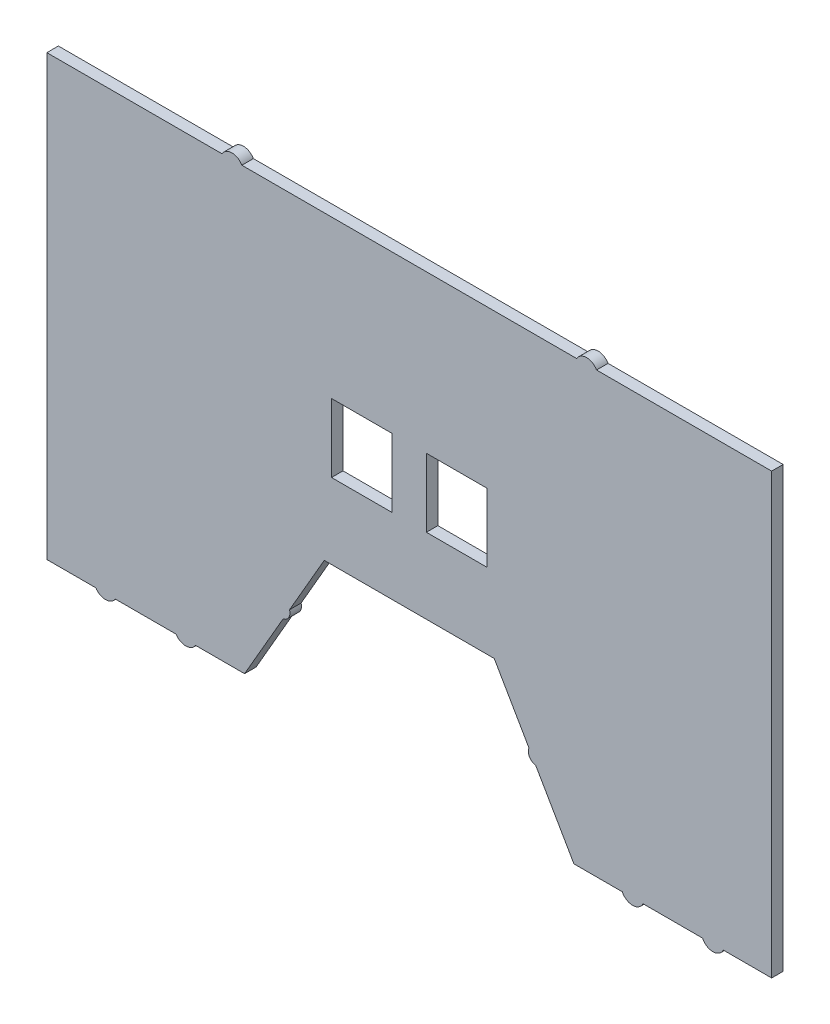
ISO-10303-21;
HEADER;
FILE_DESCRIPTION(('STEP AP214'),'2;1');
FILE_NAME('part.step','',(''),(''),'','','');
FILE_SCHEMA(('AUTOMOTIVE_DESIGN { 1 0 10303 214 1 1 1 1 }'));
ENDSEC;
DATA;
#1=APPLICATION_CONTEXT('core data for automotive mechanical design processes');
#2=APPLICATION_PROTOCOL_DEFINITION('international standard','automotive_design',2000,#1);
#3=PRODUCT_CONTEXT('',#1,'mechanical');
#4=PRODUCT('Part','Part','',(#3));
#5=PRODUCT_RELATED_PRODUCT_CATEGORY('part','',(#4));
#6=PRODUCT_DEFINITION_FORMATION('','',#4);
#7=PRODUCT_DEFINITION_CONTEXT('part definition',#1,'design');
#8=PRODUCT_DEFINITION('design','',#6,#7);
#9=PRODUCT_DEFINITION_SHAPE('','',#8);
#10=(LENGTH_UNIT() NAMED_UNIT(*) SI_UNIT(.MILLI.,.METRE.));
#11=(NAMED_UNIT(*) PLANE_ANGLE_UNIT() SI_UNIT($,.RADIAN.));
#12=(NAMED_UNIT(*) SI_UNIT($,.STERADIAN.) SOLID_ANGLE_UNIT());
#13=UNCERTAINTY_MEASURE_WITH_UNIT(LENGTH_MEASURE(1.E-05),#10,'distance_accuracy_value','');
#14=(GEOMETRIC_REPRESENTATION_CONTEXT(3) GLOBAL_UNCERTAINTY_ASSIGNED_CONTEXT((#13)) GLOBAL_UNIT_ASSIGNED_CONTEXT((#10,
#11,#12)) REPRESENTATION_CONTEXT('',''));
#15=CARTESIAN_POINT('',(0.,0.,0.));
#16=DIRECTION('',(0.,0.,1.));
#17=DIRECTION('',(1.,0.,0.));
#18=AXIS2_PLACEMENT_3D('',#15,#16,#17);
#19=CARTESIAN_POINT('',(-137.935880632151,-92.7224160690479,5.));
#20=DIRECTION('',(0.,0.,1.));
#21=DIRECTION('',(1.,0.,0.));
#22=AXIS2_PLACEMENT_3D('',#19,#20,#21);
#23=PLANE('',#22);
#24=CARTESIAN_POINT('',(-137.935880632151,-92.7224160690479,5.));
#25=DIRECTION('',(0.,0.,1.));
#26=DIRECTION('',(1.,0.,0.));
#27=AXIS2_PLACEMENT_3D('',#24,#25,#26);
#28=CIRCLE('',#27,4.99999999999952);
#29=CARTESIAN_POINT('',(-142.166061017941,-95.3880443071317,5.));
#30=VERTEX_POINT('',#29);
#31=CARTESIAN_POINT('',(-133.705700246362,-95.3880443071342,5.));
#32=VERTEX_POINT('',#31);
#33=EDGE_CURVE('E309',#30,#32,#28,.T.);
#34=ORIENTED_EDGE('',*,*,#33,.T.);
#35=DIRECTION('',(1.,0.,0.));
#36=VECTOR('',#35,1.);
#37=CARTESIAN_POINT('',(-133.705700246362,-95.3880443071342,5.));
#38=LINE('',#37,#36);
#39=CARTESIAN_POINT('',(-107.275003874018,-95.3880443071347,5.));
#40=VERTEX_POINT('',#39);
#41=EDGE_CURVE('E312',#32,#40,#38,.T.);
#42=ORIENTED_EDGE('',*,*,#41,.T.);
#43=CARTESIAN_POINT('',(-103.044823488229,-92.7224160690479,5.));
#44=DIRECTION('',(0.,0.,1.));
#45=DIRECTION('',(1.,0.,0.));
#46=AXIS2_PLACEMENT_3D('',#43,#44,#45);
#47=CIRCLE('',#46,5.00000000000033);
#48=CARTESIAN_POINT('',(-98.8146431024377,-95.3880443071321,5.));
#49=VERTEX_POINT('',#48);
#50=EDGE_CURVE('E315',#40,#49,#47,.T.);
#51=ORIENTED_EDGE('',*,*,#50,.T.);
#52=DIRECTION('',(1.,0.,0.));
#53=VECTOR('',#52,1.);
#54=CARTESIAN_POINT('',(-98.8146431024377,-95.3880443071321,5.));
#55=LINE('',#54,#53);
#56=CARTESIAN_POINT('',(-77.5104224114702,-95.388044307131,5.));
#57=VERTEX_POINT('',#56);
#58=EDGE_CURVE('E317',#49,#57,#55,.T.);
#59=ORIENTED_EDGE('',*,*,#58,.T.);
#60=DIRECTION('',(0.500000000000034,0.866025403784419,0.));
#61=VECTOR('',#60,1.);
#62=CARTESIAN_POINT('',(-77.5104224114702,-95.388044307131,5.));
#63=LINE('',#62,#61);
#64=CARTESIAN_POINT('',(-60.7650706576749,-66.3842442789476,5.));
#65=VERTEX_POINT('',#64);
#66=EDGE_CURVE('E319',#57,#65,#63,.T.);
#67=ORIENTED_EDGE('',*,*,#66,.T.);
#68=CARTESIAN_POINT('',(-61.5325916811976,-62.7136296875678,5.));
#69=DIRECTION('',(0.,0.,1.));
#70=DIRECTION('',(1.,0.,0.));
#71=AXIS2_PLACEMENT_3D('',#68,#69,#70);
#72=CIRCLE('',#71,3.74999999999997);
#73=CARTESIAN_POINT('',(-57.9699856857995,-61.5430150961871,5.));
#74=VERTEX_POINT('',#73);
#75=EDGE_CURVE('E321',#65,#74,#72,.T.);
#76=ORIENTED_EDGE('',*,*,#75,.T.);
#77=DIRECTION('',(0.5,0.866025403784439,0.));
#78=VECTOR('',#77,1.);
#79=CARTESIAN_POINT('',(-57.9699856857995,-61.5430150961871,5.));
#80=LINE('',#79,#78);
#81=CARTESIAN_POINT('',(-42.8694062600971,-35.3880443071413,5.));
#82=VERTEX_POINT('',#81);
#83=EDGE_CURVE('E323',#74,#82,#80,.T.);
#84=ORIENTED_EDGE('',*,*,#83,.T.);
#85=DIRECTION('',(1.,0.,0.));
#86=VECTOR('',#85,1.);
#87=CARTESIAN_POINT('',(-42.8694062600971,-35.3880443071413,5.));
#88=LINE('',#87,#86);
#89=CARTESIAN_POINT('',(31.0314281961877,-35.3880443071413,5.));
#90=VERTEX_POINT('',#89);
#91=EDGE_CURVE('E325',#82,#90,#88,.T.);
#92=ORIENTED_EDGE('',*,*,#91,.T.);
#93=DIRECTION('',(0.5,-0.866025403784438,0.));
#94=VECTOR('',#93,1.);
#95=CARTESIAN_POINT('',(31.0314281961877,-35.3880443071413,5.));
#96=LINE('',#95,#94);
#97=CARTESIAN_POINT('',(46.1208278246271,-61.5236511193093,5.));
#98=VERTEX_POINT('',#97);
#99=EDGE_CURVE('E327',#90,#98,#96,.T.);
#100=ORIENTED_EDGE('',*,*,#99,.T.);
#101=CARTESIAN_POINT('',(49.6024962261845,-62.9166640918249,5.));
#102=DIRECTION('',(0.,0.,1.));
#103=DIRECTION('',(1.,0.,0.));
#104=AXIS2_PLACEMENT_3D('',#101,#102,#103);
#105=CIRCLE('',#104,3.74999999999998);
#106=CARTESIAN_POINT('',(49.0680466474048,-66.6283838613848,5.));
#107=VERTEX_POINT('',#106);
#108=EDGE_CURVE('E329',#98,#107,#105,.T.);
#109=ORIENTED_EDGE('',*,*,#108,.T.);
#110=DIRECTION('',(0.5,-0.866025403784438,0.));
#111=VECTOR('',#110,1.);
#112=CARTESIAN_POINT('',(49.0680466474048,-66.6283838613848,5.));
#113=LINE('',#112,#111);
#114=CARTESIAN_POINT('',(65.6724443475645,-95.3880443071412,5.));
#115=VERTEX_POINT('',#114);
#116=EDGE_CURVE('E331',#107,#115,#113,.T.);
#117=ORIENTED_EDGE('',*,*,#116,.T.);
#118=DIRECTION('',(1.,0.,0.));
#119=VECTOR('',#118,1.);
#120=CARTESIAN_POINT('',(65.6724443475645,-95.3880443071412,5.));
#121=LINE('',#120,#119);
#122=CARTESIAN_POINT('',(86.68589336695,-95.3880443071412,5.));
#123=VERTEX_POINT('',#122);
#124=EDGE_CURVE('E333',#115,#123,#121,.T.);
#125=ORIENTED_EDGE('',*,*,#124,.T.);
#126=CARTESIAN_POINT('',(91.206010968053,-93.2506307130516,5.));
#127=DIRECTION('',(0.,0.,1.));
#128=DIRECTION('',(1.,0.,0.));
#129=AXIS2_PLACEMENT_3D('',#126,#127,#128);
#130=CIRCLE('',#129,5.);
#131=CARTESIAN_POINT('',(95.7261285691559,-95.3880443071412,5.));
#132=VERTEX_POINT('',#131);
#133=EDGE_CURVE('E335',#123,#132,#130,.T.);
#134=ORIENTED_EDGE('',*,*,#133,.T.);
#135=DIRECTION('',(1.,0.,0.));
#136=VECTOR('',#135,1.);
#137=CARTESIAN_POINT('',(95.7261285691559,-95.3880443071412,5.));
#138=LINE('',#137,#136);
#139=CARTESIAN_POINT('',(121.578619423414,-95.3880443071412,5.));
#140=VERTEX_POINT('',#139);
#141=EDGE_CURVE('E337',#132,#140,#138,.T.);
#142=ORIENTED_EDGE('',*,*,#141,.T.);
#143=CARTESIAN_POINT('',(126.098737024517,-93.2506307130516,5.));
#144=DIRECTION('',(0.,0.,1.));
#145=DIRECTION('',(1.,0.,0.));
#146=AXIS2_PLACEMENT_3D('',#143,#144,#145);
#147=CIRCLE('',#146,5.);
#148=CARTESIAN_POINT('',(130.61885462562,-95.3880443071412,5.));
#149=VERTEX_POINT('',#148);
#150=EDGE_CURVE('E339',#140,#149,#147,.T.);
#151=ORIENTED_EDGE('',*,*,#150,.T.);
#152=DIRECTION('',(1.,0.,0.));
#153=VECTOR('',#152,1.);
#154=CARTESIAN_POINT('',(130.61885462562,-95.3880443071412,5.));
#155=LINE('',#154,#153);
#156=CARTESIAN_POINT('',(151.632303645006,-95.3880443071412,5.));
#157=VERTEX_POINT('',#156);
#158=EDGE_CURVE('E341',#149,#157,#155,.T.);
#159=ORIENTED_EDGE('',*,*,#158,.T.);
#160=DIRECTION('',(0.,1.,0.));
#161=VECTOR('',#160,1.);
#162=CARTESIAN_POINT('',(151.632303645006,-95.3880443071412,5.));
#163=LINE('',#162,#161);
#164=CARTESIAN_POINT('',(151.632303645003,95.4654001801671,5.));
#165=VERTEX_POINT('',#164);
#166=EDGE_CURVE('E343',#157,#165,#163,.T.);
#167=ORIENTED_EDGE('',*,*,#166,.T.);
#168=DIRECTION('',(-1.,0.,0.));
#169=VECTOR('',#168,1.);
#170=CARTESIAN_POINT('',(151.632303645003,95.4654001801671,5.));
#171=LINE('',#170,#169);
#172=CARTESIAN_POINT('',(75.5121501980686,95.4654001801671,5.));
#173=VERTEX_POINT('',#172);
#174=EDGE_CURVE('E345',#165,#173,#171,.T.);
#175=ORIENTED_EDGE('',*,*,#174,.T.);
#176=CARTESIAN_POINT('',(71.1820231791464,92.9654001801671,5.));
#177=DIRECTION('',(0.,0.,1.));
#178=DIRECTION('',(1.,0.,0.));
#179=AXIS2_PLACEMENT_3D('',#176,#177,#178);
#180=CIRCLE('',#179,4.99999999999999);
#181=CARTESIAN_POINT('',(66.8518961602242,95.4654001801671,5.));
#182=VERTEX_POINT('',#181);
#183=EDGE_CURVE('E347',#173,#182,#180,.T.);
#184=ORIENTED_EDGE('',*,*,#183,.T.);
#185=DIRECTION('',(-1.,0.,0.));
#186=VECTOR('',#185,1.);
#187=CARTESIAN_POINT('',(66.8518961602242,95.4654001801671,5.));
#188=LINE('',#187,#186);
#189=CARTESIAN_POINT('',(-78.6897807355151,95.4654001801671,5.));
#190=VERTEX_POINT('',#189);
#191=EDGE_CURVE('E349',#182,#190,#188,.T.);
#192=ORIENTED_EDGE('',*,*,#191,.T.);
#193=CARTESIAN_POINT('',(-83.0199077544373,92.9654001801671,5.));
#194=DIRECTION('',(0.,0.,1.));
#195=DIRECTION('',(1.,0.,0.));
#196=AXIS2_PLACEMENT_3D('',#193,#194,#195);
#197=CIRCLE('',#196,5.00000000000001);
#198=CARTESIAN_POINT('',(-87.3500347733596,95.465400180167,5.));
#199=VERTEX_POINT('',#198);
#200=EDGE_CURVE('E351',#190,#199,#197,.T.);
#201=ORIENTED_EDGE('',*,*,#200,.T.);
#202=DIRECTION('',(-1.,0.,0.));
#203=VECTOR('',#202,1.);
#204=CARTESIAN_POINT('',(-87.3500347733596,95.465400180167,5.));
#205=LINE('',#204,#203);
#206=CARTESIAN_POINT('',(-163.470281708909,95.465400180167,5.));
#207=VERTEX_POINT('',#206);
#208=EDGE_CURVE('E353',#199,#207,#205,.T.);
#209=ORIENTED_EDGE('',*,*,#208,.T.);
#210=DIRECTION('',(0.,-1.,0.));
#211=VECTOR('',#210,1.);
#212=CARTESIAN_POINT('',(-163.470281708909,95.465400180167,5.));
#213=LINE('',#212,#211);
#214=CARTESIAN_POINT('',(-163.470281708909,-95.3880443071336,5.));
#215=VERTEX_POINT('',#214);
#216=EDGE_CURVE('E355',#207,#215,#213,.T.);
#217=ORIENTED_EDGE('',*,*,#216,.T.);
#218=DIRECTION('',(1.,0.,0.));
#219=VECTOR('',#218,1.);
#220=CARTESIAN_POINT('',(-163.470281708909,-95.3880443071336,5.));
#221=LINE('',#220,#219);
#222=EDGE_CURVE('E357',#215,#30,#221,.T.);
#223=ORIENTED_EDGE('',*,*,#222,.T.);
#224=EDGE_LOOP('',(#34,#42,#51,#59,#67,#76,#84,#92,#100,#109,#117,#125,#134,#142,#151,#159,#167,
#175,#184,#192,#201,#209,#217,#223));
#225=FACE_BOUND('',#224,.T.);
#226=DIRECTION('',(1.,0.,0.));
#227=VECTOR('',#226,1.);
#228=CARTESIAN_POINT('',(-39.7253930790234,-2.62456763794061,5.));
#229=LINE('',#228,#227);
#230=CARTESIAN_POINT('',(-39.7253930790234,-2.62456763794061,5.));
#231=VERTEX_POINT('',#230);
#232=CARTESIAN_POINT('',(-13.366639796097,-2.62456763794061,5.));
#233=VERTEX_POINT('',#232);
#234=EDGE_CURVE('E280',#231,#233,#229,.T.);
#235=ORIENTED_EDGE('',*,*,#234,.F.);
#236=DIRECTION('',(0.,-1.,0.));
#237=VECTOR('',#236,1.);
#238=CARTESIAN_POINT('',(-39.7253930790234,27.1353151008472,5.));
#239=LINE('',#238,#237);
#240=CARTESIAN_POINT('',(-39.7253930790234,27.1353151008472,5.));
#241=VERTEX_POINT('',#240);
#242=EDGE_CURVE('E278',#241,#231,#239,.T.);
#243=ORIENTED_EDGE('',*,*,#242,.F.);
#244=DIRECTION('',(-1.,0.,0.));
#245=VECTOR('',#244,1.);
#246=CARTESIAN_POINT('',(-39.7253930790234,27.1353151008472,5.));
#247=LINE('',#246,#245);
#248=CARTESIAN_POINT('',(-13.366639796097,27.1353151008472,5.));
#249=VERTEX_POINT('',#248);
#250=EDGE_CURVE('E286',#249,#241,#247,.T.);
#251=ORIENTED_EDGE('',*,*,#250,.F.);
#252=DIRECTION('',(0.,1.,0.));
#253=VECTOR('',#252,1.);
#254=CARTESIAN_POINT('',(-13.366639796097,27.1353151008472,5.));
#255=LINE('',#254,#253);
#256=EDGE_CURVE('E283',#233,#249,#255,.T.);
#257=ORIENTED_EDGE('',*,*,#256,.F.);
#258=EDGE_LOOP('',(#235,#243,#251,#257));
#259=FACE_BOUND('',#258,.T.);
#260=DIRECTION('',(1.,0.,0.));
#261=VECTOR('',#260,1.);
#262=CARTESIAN_POINT('',(1.52875522080613,-2.62456763794056,5.));
#263=LINE('',#262,#261);
#264=CARTESIAN_POINT('',(1.52875522080613,-2.62456763794056,5.));
#265=VERTEX_POINT('',#264);
#266=CARTESIAN_POINT('',(27.8875085037325,-2.62456763794056,5.));
#267=VERTEX_POINT('',#266);
#268=EDGE_CURVE('E250',#265,#267,#263,.T.);
#269=ORIENTED_EDGE('',*,*,#268,.F.);
#270=DIRECTION('',(0.,-1.,0.));
#271=VECTOR('',#270,1.);
#272=CARTESIAN_POINT('',(1.52875522080612,27.1353151008472,5.));
#273=LINE('',#272,#271);
#274=CARTESIAN_POINT('',(1.52875522080612,27.1353151008472,5.));
#275=VERTEX_POINT('',#274);
#276=EDGE_CURVE('E242',#275,#265,#273,.T.);
#277=ORIENTED_EDGE('',*,*,#276,.F.);
#278=DIRECTION('',(-1.,0.,0.));
#279=VECTOR('',#278,1.);
#280=CARTESIAN_POINT('',(1.52875522080612,27.1353151008472,5.));
#281=LINE('',#280,#279);
#282=CARTESIAN_POINT('',(27.8875085037325,27.1353151008472,5.));
#283=VERTEX_POINT('',#282);
#284=EDGE_CURVE('E264',#283,#275,#281,.T.);
#285=ORIENTED_EDGE('',*,*,#284,.F.);
#286=DIRECTION('',(0.,1.,0.));
#287=VECTOR('',#286,1.);
#288=CARTESIAN_POINT('',(27.8875085037325,27.1353151008472,5.));
#289=LINE('',#288,#287);
#290=EDGE_CURVE('E262',#267,#283,#289,.T.);
#291=ORIENTED_EDGE('',*,*,#290,.F.);
#292=EDGE_LOOP('',(#269,#277,#285,#291));
#293=FACE_BOUND('',#292,.T.);
#294=ADVANCED_FACE('F33',(#225,#259,#293),#23,.T.);
#295=CARTESIAN_POINT('',(-137.935880632151,-92.7224160690479,0.));
#296=DIRECTION('',(0.,0.,1.));
#297=DIRECTION('',(1.,0.,0.));
#298=AXIS2_PLACEMENT_3D('',#295,#296,#297);
#299=PLANE('',#298);
#300=DIRECTION('',(0.,-1.,0.));
#301=VECTOR('',#300,1.);
#302=CARTESIAN_POINT('',(-39.7253930790234,27.1353151008472,0.));
#303=LINE('',#302,#301);
#304=CARTESIAN_POINT('',(-39.7253930790234,27.1353151008472,0.));
#305=VERTEX_POINT('',#304);
#306=CARTESIAN_POINT('',(-39.7253930790234,-2.62456763794061,0.));
#307=VERTEX_POINT('',#306);
#308=EDGE_CURVE('E258',#305,#307,#303,.T.);
#309=ORIENTED_EDGE('',*,*,#308,.T.);
#310=DIRECTION('',(1.,0.,0.));
#311=VECTOR('',#310,1.);
#312=CARTESIAN_POINT('',(-39.7253930790234,-2.62456763794061,0.));
#313=LINE('',#312,#311);
#314=CARTESIAN_POINT('',(-13.366639796097,-2.62456763794061,0.));
#315=VERTEX_POINT('',#314);
#316=EDGE_CURVE('E291',#307,#315,#313,.T.);
#317=ORIENTED_EDGE('',*,*,#316,.T.);
#318=DIRECTION('',(0.,1.,0.));
#319=VECTOR('',#318,1.);
#320=CARTESIAN_POINT('',(-13.366639796097,27.1353151008472,0.));
#321=LINE('',#320,#319);
#322=CARTESIAN_POINT('',(-13.366639796097,27.1353151008472,0.));
#323=VERTEX_POINT('',#322);
#324=EDGE_CURVE('E294',#315,#323,#321,.T.);
#325=ORIENTED_EDGE('',*,*,#324,.T.);
#326=DIRECTION('',(-1.,0.,0.));
#327=VECTOR('',#326,1.);
#328=CARTESIAN_POINT('',(-39.7253930790234,27.1353151008472,0.));
#329=LINE('',#328,#327);
#330=EDGE_CURVE('E281',#323,#305,#329,.T.);
#331=ORIENTED_EDGE('',*,*,#330,.T.);
#332=EDGE_LOOP('',(#309,#317,#325,#331));
#333=FACE_BOUND('',#332,.T.);
#334=CARTESIAN_POINT('',(-137.935880632151,-92.7224160690479,0.));
#335=DIRECTION('',(0.,0.,1.));
#336=DIRECTION('',(1.,0.,0.));
#337=AXIS2_PLACEMENT_3D('',#334,#335,#336);
#338=CIRCLE('',#337,4.99999999999952);
#339=CARTESIAN_POINT('',(-142.166061017941,-95.3880443071317,0.));
#340=VERTEX_POINT('',#339);
#341=CARTESIAN_POINT('',(-133.705700246362,-95.3880443071342,0.));
#342=VERTEX_POINT('',#341);
#343=EDGE_CURVE('E308',#340,#342,#338,.T.);
#344=ORIENTED_EDGE('',*,*,#343,.F.);
#345=DIRECTION('',(1.,0.,0.));
#346=VECTOR('',#345,1.);
#347=CARTESIAN_POINT('',(-163.470281708909,-95.3880443071336,0.));
#348=LINE('',#347,#346);
#349=CARTESIAN_POINT('',(-163.470281708909,-95.3880443071336,0.));
#350=VERTEX_POINT('',#349);
#351=EDGE_CURVE('E313',#350,#340,#348,.T.);
#352=ORIENTED_EDGE('',*,*,#351,.F.);
#353=DIRECTION('',(0.,-1.,0.));
#354=VECTOR('',#353,1.);
#355=CARTESIAN_POINT('',(-163.470281708909,95.465400180167,0.));
#356=LINE('',#355,#354);
#357=CARTESIAN_POINT('',(-163.470281708909,95.465400180167,0.));
#358=VERTEX_POINT('',#357);
#359=EDGE_CURVE('E404',#358,#350,#356,.T.);
#360=ORIENTED_EDGE('',*,*,#359,.F.);
#361=DIRECTION('',(-1.,0.,0.));
#362=VECTOR('',#361,1.);
#363=CARTESIAN_POINT('',(-87.3500347733596,95.465400180167,0.));
#364=LINE('',#363,#362);
#365=CARTESIAN_POINT('',(-87.3500347733596,95.465400180167,0.));
#366=VERTEX_POINT('',#365);
#367=EDGE_CURVE('E402',#366,#358,#364,.T.);
#368=ORIENTED_EDGE('',*,*,#367,.F.);
#369=CARTESIAN_POINT('',(-83.0199077544373,92.9654001801671,0.));
#370=DIRECTION('',(0.,0.,1.));
#371=DIRECTION('',(1.,0.,0.));
#372=AXIS2_PLACEMENT_3D('',#369,#370,#371);
#373=CIRCLE('',#372,5.00000000000001);
#374=CARTESIAN_POINT('',(-78.6897807355151,95.4654001801671,0.));
#375=VERTEX_POINT('',#374);
#376=EDGE_CURVE('E400',#375,#366,#373,.T.);
#377=ORIENTED_EDGE('',*,*,#376,.F.);
#378=DIRECTION('',(-1.,0.,0.));
#379=VECTOR('',#378,1.);
#380=CARTESIAN_POINT('',(66.8518961602242,95.4654001801671,0.));
#381=LINE('',#380,#379);
#382=CARTESIAN_POINT('',(66.8518961602242,95.4654001801671,0.));
#383=VERTEX_POINT('',#382);
#384=EDGE_CURVE('E398',#383,#375,#381,.T.);
#385=ORIENTED_EDGE('',*,*,#384,.F.);
#386=CARTESIAN_POINT('',(71.1820231791464,92.9654001801671,0.));
#387=DIRECTION('',(0.,0.,1.));
#388=DIRECTION('',(1.,0.,0.));
#389=AXIS2_PLACEMENT_3D('',#386,#387,#388);
#390=CIRCLE('',#389,4.99999999999999);
#391=CARTESIAN_POINT('',(75.5121501980686,95.4654001801671,0.));
#392=VERTEX_POINT('',#391);
#393=EDGE_CURVE('E396',#392,#383,#390,.T.);
#394=ORIENTED_EDGE('',*,*,#393,.F.);
#395=DIRECTION('',(-1.,0.,0.));
#396=VECTOR('',#395,1.);
#397=CARTESIAN_POINT('',(151.632303645003,95.4654001801671,0.));
#398=LINE('',#397,#396);
#399=CARTESIAN_POINT('',(151.632303645003,95.4654001801671,0.));
#400=VERTEX_POINT('',#399);
#401=EDGE_CURVE('E394',#400,#392,#398,.T.);
#402=ORIENTED_EDGE('',*,*,#401,.F.);
#403=DIRECTION('',(0.,1.,0.));
#404=VECTOR('',#403,1.);
#405=CARTESIAN_POINT('',(151.632303645006,-95.3880443071412,0.));
#406=LINE('',#405,#404);
#407=CARTESIAN_POINT('',(151.632303645006,-95.3880443071412,0.));
#408=VERTEX_POINT('',#407);
#409=EDGE_CURVE('E392',#408,#400,#406,.T.);
#410=ORIENTED_EDGE('',*,*,#409,.F.);
#411=DIRECTION('',(1.,0.,0.));
#412=VECTOR('',#411,1.);
#413=CARTESIAN_POINT('',(130.61885462562,-95.3880443071412,0.));
#414=LINE('',#413,#412);
#415=CARTESIAN_POINT('',(130.61885462562,-95.3880443071412,0.));
#416=VERTEX_POINT('',#415);
#417=EDGE_CURVE('E390',#416,#408,#414,.T.);
#418=ORIENTED_EDGE('',*,*,#417,.F.);
#419=CARTESIAN_POINT('',(126.098737024517,-93.2506307130516,0.));
#420=DIRECTION('',(0.,0.,1.));
#421=DIRECTION('',(1.,0.,0.));
#422=AXIS2_PLACEMENT_3D('',#419,#420,#421);
#423=CIRCLE('',#422,5.);
#424=CARTESIAN_POINT('',(121.578619423414,-95.3880443071412,0.));
#425=VERTEX_POINT('',#424);
#426=EDGE_CURVE('E388',#425,#416,#423,.T.);
#427=ORIENTED_EDGE('',*,*,#426,.F.);
#428=DIRECTION('',(1.,0.,0.));
#429=VECTOR('',#428,1.);
#430=CARTESIAN_POINT('',(95.7261285691559,-95.3880443071412,0.));
#431=LINE('',#430,#429);
#432=CARTESIAN_POINT('',(95.7261285691559,-95.3880443071412,0.));
#433=VERTEX_POINT('',#432);
#434=EDGE_CURVE('E386',#433,#425,#431,.T.);
#435=ORIENTED_EDGE('',*,*,#434,.F.);
#436=CARTESIAN_POINT('',(91.206010968053,-93.2506307130516,0.));
#437=DIRECTION('',(0.,0.,1.));
#438=DIRECTION('',(1.,0.,0.));
#439=AXIS2_PLACEMENT_3D('',#436,#437,#438);
#440=CIRCLE('',#439,5.);
#441=CARTESIAN_POINT('',(86.68589336695,-95.3880443071412,0.));
#442=VERTEX_POINT('',#441);
#443=EDGE_CURVE('E384',#442,#433,#440,.T.);
#444=ORIENTED_EDGE('',*,*,#443,.F.);
#445=DIRECTION('',(1.,0.,0.));
#446=VECTOR('',#445,1.);
#447=CARTESIAN_POINT('',(65.6724443475645,-95.3880443071412,0.));
#448=LINE('',#447,#446);
#449=CARTESIAN_POINT('',(65.6724443475645,-95.3880443071412,0.));
#450=VERTEX_POINT('',#449);
#451=EDGE_CURVE('E382',#450,#442,#448,.T.);
#452=ORIENTED_EDGE('',*,*,#451,.F.);
#453=DIRECTION('',(0.5,-0.866025403784438,0.));
#454=VECTOR('',#453,1.);
#455=CARTESIAN_POINT('',(49.0680466474048,-66.6283838613848,0.));
#456=LINE('',#455,#454);
#457=CARTESIAN_POINT('',(49.0680466474048,-66.6283838613848,0.));
#458=VERTEX_POINT('',#457);
#459=EDGE_CURVE('E380',#458,#450,#456,.T.);
#460=ORIENTED_EDGE('',*,*,#459,.F.);
#461=CARTESIAN_POINT('',(49.6024962261845,-62.9166640918249,0.));
#462=DIRECTION('',(0.,0.,1.));
#463=DIRECTION('',(1.,0.,0.));
#464=AXIS2_PLACEMENT_3D('',#461,#462,#463);
#465=CIRCLE('',#464,3.74999999999998);
#466=CARTESIAN_POINT('',(46.1208278246271,-61.5236511193093,0.));
#467=VERTEX_POINT('',#466);
#468=EDGE_CURVE('E378',#467,#458,#465,.T.);
#469=ORIENTED_EDGE('',*,*,#468,.F.);
#470=DIRECTION('',(0.5,-0.866025403784438,0.));
#471=VECTOR('',#470,1.);
#472=CARTESIAN_POINT('',(31.0314281961877,-35.3880443071413,0.));
#473=LINE('',#472,#471);
#474=CARTESIAN_POINT('',(31.0314281961877,-35.3880443071413,0.));
#475=VERTEX_POINT('',#474);
#476=EDGE_CURVE('E376',#475,#467,#473,.T.);
#477=ORIENTED_EDGE('',*,*,#476,.F.);
#478=DIRECTION('',(1.,0.,0.));
#479=VECTOR('',#478,1.);
#480=CARTESIAN_POINT('',(-42.8694062600971,-35.3880443071413,0.));
#481=LINE('',#480,#479);
#482=CARTESIAN_POINT('',(-42.8694062600971,-35.3880443071413,0.));
#483=VERTEX_POINT('',#482);
#484=EDGE_CURVE('E374',#483,#475,#481,.T.);
#485=ORIENTED_EDGE('',*,*,#484,.F.);
#486=DIRECTION('',(0.5,0.866025403784439,0.));
#487=VECTOR('',#486,1.);
#488=CARTESIAN_POINT('',(-57.9699856857995,-61.5430150961871,0.));
#489=LINE('',#488,#487);
#490=CARTESIAN_POINT('',(-57.9699856857995,-61.5430150961871,0.));
#491=VERTEX_POINT('',#490);
#492=EDGE_CURVE('E372',#491,#483,#489,.T.);
#493=ORIENTED_EDGE('',*,*,#492,.F.);
#494=CARTESIAN_POINT('',(-61.5325916811976,-62.7136296875678,0.));
#495=DIRECTION('',(0.,0.,1.));
#496=DIRECTION('',(1.,0.,0.));
#497=AXIS2_PLACEMENT_3D('',#494,#495,#496);
#498=CIRCLE('',#497,3.74999999999997);
#499=CARTESIAN_POINT('',(-60.7650706576749,-66.3842442789476,0.));
#500=VERTEX_POINT('',#499);
#501=EDGE_CURVE('E370',#500,#491,#498,.T.);
#502=ORIENTED_EDGE('',*,*,#501,.F.);
#503=DIRECTION('',(0.500000000000034,0.866025403784419,0.));
#504=VECTOR('',#503,1.);
#505=CARTESIAN_POINT('',(-77.5104224114702,-95.388044307131,0.));
#506=LINE('',#505,#504);
#507=CARTESIAN_POINT('',(-77.5104224114702,-95.388044307131,0.));
#508=VERTEX_POINT('',#507);
#509=EDGE_CURVE('E368',#508,#500,#506,.T.);
#510=ORIENTED_EDGE('',*,*,#509,.F.);
#511=DIRECTION('',(1.,0.,0.));
#512=VECTOR('',#511,1.);
#513=CARTESIAN_POINT('',(-98.8146431024377,-95.3880443071321,0.));
#514=LINE('',#513,#512);
#515=CARTESIAN_POINT('',(-98.8146431024377,-95.3880443071321,0.));
#516=VERTEX_POINT('',#515);
#517=EDGE_CURVE('E366',#516,#508,#514,.T.);
#518=ORIENTED_EDGE('',*,*,#517,.F.);
#519=CARTESIAN_POINT('',(-103.044823488229,-92.7224160690479,0.));
#520=DIRECTION('',(0.,0.,1.));
#521=DIRECTION('',(1.,0.,0.));
#522=AXIS2_PLACEMENT_3D('',#519,#520,#521);
#523=CIRCLE('',#522,5.00000000000033);
#524=CARTESIAN_POINT('',(-107.275003874018,-95.3880443071347,0.));
#525=VERTEX_POINT('',#524);
#526=EDGE_CURVE('E364',#525,#516,#523,.T.);
#527=ORIENTED_EDGE('',*,*,#526,.F.);
#528=DIRECTION('',(1.,0.,0.));
#529=VECTOR('',#528,1.);
#530=CARTESIAN_POINT('',(-133.705700246362,-95.3880443071342,0.));
#531=LINE('',#530,#529);
#532=EDGE_CURVE('E362',#342,#525,#531,.T.);
#533=ORIENTED_EDGE('',*,*,#532,.F.);
#534=EDGE_LOOP('',(#344,#352,#360,#368,#377,#385,#394,#402,#410,#418,#427,#435,#444,#452,#460,
#469,#477,#485,#493,#502,#510,#518,#527,#533));
#535=FACE_BOUND('',#534,.T.);
#536=DIRECTION('',(0.,-1.,0.));
#537=VECTOR('',#536,1.);
#538=CARTESIAN_POINT('',(1.52875522080612,27.1353151008472,0.));
#539=LINE('',#538,#537);
#540=CARTESIAN_POINT('',(1.52875522080612,27.1353151008472,0.));
#541=VERTEX_POINT('',#540);
#542=CARTESIAN_POINT('',(1.52875522080613,-2.62456763794056,0.));
#543=VERTEX_POINT('',#542);
#544=EDGE_CURVE('E56',#541,#543,#539,.T.);
#545=ORIENTED_EDGE('',*,*,#544,.T.);
#546=DIRECTION('',(1.,0.,0.));
#547=VECTOR('',#546,1.);
#548=CARTESIAN_POINT('',(1.52875522080613,-2.62456763794056,0.));
#549=LINE('',#548,#547);
#550=CARTESIAN_POINT('',(27.8875085037325,-2.62456763794056,0.));
#551=VERTEX_POINT('',#550);
#552=EDGE_CURVE('E257',#543,#551,#549,.T.);
#553=ORIENTED_EDGE('',*,*,#552,.T.);
#554=DIRECTION('',(0.,1.,0.));
#555=VECTOR('',#554,1.);
#556=CARTESIAN_POINT('',(27.8875085037325,27.1353151008472,0.));
#557=LINE('',#556,#555);
#558=CARTESIAN_POINT('',(27.8875085037325,27.1353151008472,0.));
#559=VERTEX_POINT('',#558);
#560=EDGE_CURVE('E270',#551,#559,#557,.T.);
#561=ORIENTED_EDGE('',*,*,#560,.T.);
#562=DIRECTION('',(-1.,0.,0.));
#563=VECTOR('',#562,1.);
#564=CARTESIAN_POINT('',(1.52875522080612,27.1353151008472,0.));
#565=LINE('',#564,#563);
#566=EDGE_CURVE('E251',#559,#541,#565,.T.);
#567=ORIENTED_EDGE('',*,*,#566,.T.);
#568=EDGE_LOOP('',(#545,#553,#561,#567));
#569=FACE_BOUND('',#568,.T.);
#570=ADVANCED_FACE('F482',(#333,#535,#569),#299,.F.);
#571=CARTESIAN_POINT('',(-137.935880632151,-92.7224160690479,5.));
#572=DIRECTION('',(0.,0.,-1.));
#573=DIRECTION('',(-1.,0.,0.));
#574=AXIS2_PLACEMENT_3D('',#571,#572,#573);
#575=CYLINDRICAL_SURFACE('',#574,4.99999999999952);
#576=ORIENTED_EDGE('',*,*,#343,.T.);
#577=DIRECTION('',(0.,0.,-1.));
#578=VECTOR('',#577,1.);
#579=CARTESIAN_POINT('',(-133.705700246362,-95.3880443071342,5.));
#580=LINE('',#579,#578);
#581=EDGE_CURVE('E11',#32,#342,#580,.T.);
#582=ORIENTED_EDGE('',*,*,#581,.F.);
#583=ORIENTED_EDGE('',*,*,#33,.F.);
#584=DIRECTION('',(0.,0.,-1.));
#585=VECTOR('',#584,1.);
#586=CARTESIAN_POINT('',(-142.166061017941,-95.3880443071317,5.));
#587=LINE('',#586,#585);
#588=EDGE_CURVE('E359',#30,#340,#587,.T.);
#589=ORIENTED_EDGE('',*,*,#588,.T.);
#590=EDGE_LOOP('',(#576,#582,#583,#589));
#591=FACE_BOUND('',#590,.T.);
#592=ADVANCED_FACE('F35',(#591),#575,.T.);
#593=CARTESIAN_POINT('',(-133.705700246362,-95.3880443071342,5.));
#594=DIRECTION('',(0.,1.,0.));
#595=DIRECTION('',(-1.,0.,0.));
#596=AXIS2_PLACEMENT_3D('',#593,#594,#595);
#597=PLANE('',#596);
#598=ORIENTED_EDGE('',*,*,#532,.T.);
#599=DIRECTION('',(0.,0.,-1.));
#600=VECTOR('',#599,1.);
#601=CARTESIAN_POINT('',(-107.275003874018,-95.3880443071347,5.));
#602=LINE('',#601,#600);
#603=EDGE_CURVE('E41',#40,#525,#602,.T.);
#604=ORIENTED_EDGE('',*,*,#603,.F.);
#605=ORIENTED_EDGE('',*,*,#41,.F.);
#606=ORIENTED_EDGE('',*,*,#581,.T.);
#607=EDGE_LOOP('',(#598,#604,#605,#606));
#608=FACE_BOUND('',#607,.T.);
#609=ADVANCED_FACE('F500',(#608),#597,.F.);
#610=CARTESIAN_POINT('',(-103.044823488229,-92.7224160690479,5.));
#611=DIRECTION('',(0.,0.,-1.));
#612=DIRECTION('',(-1.,0.,0.));
#613=AXIS2_PLACEMENT_3D('',#610,#611,#612);
#614=CYLINDRICAL_SURFACE('',#613,5.00000000000033);
#615=ORIENTED_EDGE('',*,*,#526,.T.);
#616=DIRECTION('',(0.,0.,-1.));
#617=VECTOR('',#616,1.);
#618=CARTESIAN_POINT('',(-98.8146431024377,-95.3880443071321,5.));
#619=LINE('',#618,#617);
#620=EDGE_CURVE('E469',#49,#516,#619,.T.);
#621=ORIENTED_EDGE('',*,*,#620,.F.);
#622=ORIENTED_EDGE('',*,*,#50,.F.);
#623=ORIENTED_EDGE('',*,*,#603,.T.);
#624=EDGE_LOOP('',(#615,#621,#622,#623));
#625=FACE_BOUND('',#624,.T.);
#626=ADVANCED_FACE('F476',(#625),#614,.T.);
#627=CARTESIAN_POINT('',(-98.8146431024377,-95.3880443071321,5.));
#628=DIRECTION('',(0.,1.,0.));
#629=DIRECTION('',(-1.,0.,0.));
#630=AXIS2_PLACEMENT_3D('',#627,#628,#629);
#631=PLANE('',#630);
#632=ORIENTED_EDGE('',*,*,#517,.T.);
#633=DIRECTION('',(0.,0.,-1.));
#634=VECTOR('',#633,1.);
#635=CARTESIAN_POINT('',(-77.5104224114702,-95.388044307131,5.));
#636=LINE('',#635,#634);
#637=EDGE_CURVE('E466',#57,#508,#636,.T.);
#638=ORIENTED_EDGE('',*,*,#637,.F.);
#639=ORIENTED_EDGE('',*,*,#58,.F.);
#640=ORIENTED_EDGE('',*,*,#620,.T.);
#641=EDGE_LOOP('',(#632,#638,#639,#640));
#642=FACE_BOUND('',#641,.T.);
#643=ADVANCED_FACE('F488',(#642),#631,.F.);
#644=CARTESIAN_POINT('',(-77.5104224114702,-95.388044307131,5.));
#645=DIRECTION('',(-0.866025403784419,0.500000000000034,0.));
#646=DIRECTION('',(-0.500000000000034,-0.866025403784419,0.));
#647=AXIS2_PLACEMENT_3D('',#644,#645,#646);
#648=PLANE('',#647);
#649=ORIENTED_EDGE('',*,*,#509,.T.);
#650=DIRECTION('',(0.,0.,-1.));
#651=VECTOR('',#650,1.);
#652=CARTESIAN_POINT('',(-60.7650706576749,-66.3842442789476,5.));
#653=LINE('',#652,#651);
#654=EDGE_CURVE('E463',#65,#500,#653,.T.);
#655=ORIENTED_EDGE('',*,*,#654,.F.);
#656=ORIENTED_EDGE('',*,*,#66,.F.);
#657=ORIENTED_EDGE('',*,*,#637,.T.);
#658=EDGE_LOOP('',(#649,#655,#656,#657));
#659=FACE_BOUND('',#658,.T.);
#660=ADVANCED_FACE('F492',(#659),#648,.F.);
#661=CARTESIAN_POINT('',(-61.5325916811976,-62.7136296875678,5.));
#662=DIRECTION('',(0.,0.,-1.));
#663=DIRECTION('',(-1.,0.,0.));
#664=AXIS2_PLACEMENT_3D('',#661,#662,#663);
#665=CYLINDRICAL_SURFACE('',#664,3.74999999999997);
#666=ORIENTED_EDGE('',*,*,#501,.T.);
#667=DIRECTION('',(0.,0.,-1.));
#668=VECTOR('',#667,1.);
#669=CARTESIAN_POINT('',(-57.9699856857995,-61.5430150961871,5.));
#670=LINE('',#669,#668);
#671=EDGE_CURVE('E460',#74,#491,#670,.T.);
#672=ORIENTED_EDGE('',*,*,#671,.F.);
#673=ORIENTED_EDGE('',*,*,#75,.F.);
#674=ORIENTED_EDGE('',*,*,#654,.T.);
#675=EDGE_LOOP('',(#666,#672,#673,#674));
#676=FACE_BOUND('',#675,.T.);
#677=ADVANCED_FACE('F593',(#676),#665,.T.);
#678=CARTESIAN_POINT('',(-57.9699856857995,-61.5430150961871,5.));
#679=DIRECTION('',(-0.866025403784439,0.5,0.));
#680=DIRECTION('',(-0.5,-0.866025403784439,0.));
#681=AXIS2_PLACEMENT_3D('',#678,#679,#680);
#682=PLANE('',#681);
#683=ORIENTED_EDGE('',*,*,#492,.T.);
#684=DIRECTION('',(0.,0.,-1.));
#685=VECTOR('',#684,1.);
#686=CARTESIAN_POINT('',(-42.8694062600971,-35.3880443071413,5.));
#687=LINE('',#686,#685);
#688=EDGE_CURVE('E457',#82,#483,#687,.T.);
#689=ORIENTED_EDGE('',*,*,#688,.F.);
#690=ORIENTED_EDGE('',*,*,#83,.F.);
#691=ORIENTED_EDGE('',*,*,#671,.T.);
#692=EDGE_LOOP('',(#683,#689,#690,#691));
#693=FACE_BOUND('',#692,.T.);
#694=ADVANCED_FACE('F591',(#693),#682,.F.);
#695=CARTESIAN_POINT('',(-42.8694062600971,-35.3880443071413,5.));
#696=DIRECTION('',(0.,1.,0.));
#697=DIRECTION('',(-1.,0.,0.));
#698=AXIS2_PLACEMENT_3D('',#695,#696,#697);
#699=PLANE('',#698);
#700=ORIENTED_EDGE('',*,*,#484,.T.);
#701=DIRECTION('',(0.,0.,-1.));
#702=VECTOR('',#701,1.);
#703=CARTESIAN_POINT('',(31.0314281961877,-35.3880443071413,5.));
#704=LINE('',#703,#702);
#705=EDGE_CURVE('E454',#90,#475,#704,.T.);
#706=ORIENTED_EDGE('',*,*,#705,.F.);
#707=ORIENTED_EDGE('',*,*,#91,.F.);
#708=ORIENTED_EDGE('',*,*,#688,.T.);
#709=EDGE_LOOP('',(#700,#706,#707,#708));
#710=FACE_BOUND('',#709,.T.);
#711=ADVANCED_FACE('F587',(#710),#699,.F.);
#712=CARTESIAN_POINT('',(31.0314281961877,-35.3880443071413,5.));
#713=DIRECTION('',(0.866025403784439,0.5,0.));
#714=DIRECTION('',(-0.5,0.866025403784439,0.));
#715=AXIS2_PLACEMENT_3D('',#712,#713,#714);
#716=PLANE('',#715);
#717=ORIENTED_EDGE('',*,*,#476,.T.);
#718=DIRECTION('',(0.,0.,-1.));
#719=VECTOR('',#718,1.);
#720=CARTESIAN_POINT('',(46.1208278246271,-61.5236511193093,5.));
#721=LINE('',#720,#719);
#722=EDGE_CURVE('E451',#98,#467,#721,.T.);
#723=ORIENTED_EDGE('',*,*,#722,.F.);
#724=ORIENTED_EDGE('',*,*,#99,.F.);
#725=ORIENTED_EDGE('',*,*,#705,.T.);
#726=EDGE_LOOP('',(#717,#723,#724,#725));
#727=FACE_BOUND('',#726,.T.);
#728=ADVANCED_FACE('F582',(#727),#716,.F.);
#729=CARTESIAN_POINT('',(49.6024962261845,-62.9166640918249,5.));
#730=DIRECTION('',(0.,0.,-1.));
#731=DIRECTION('',(-1.,0.,0.));
#732=AXIS2_PLACEMENT_3D('',#729,#730,#731);
#733=CYLINDRICAL_SURFACE('',#732,3.74999999999998);
#734=ORIENTED_EDGE('',*,*,#468,.T.);
#735=DIRECTION('',(0.,0.,-1.));
#736=VECTOR('',#735,1.);
#737=CARTESIAN_POINT('',(49.0680466474048,-66.6283838613848,5.));
#738=LINE('',#737,#736);
#739=EDGE_CURVE('E448',#107,#458,#738,.T.);
#740=ORIENTED_EDGE('',*,*,#739,.F.);
#741=ORIENTED_EDGE('',*,*,#108,.F.);
#742=ORIENTED_EDGE('',*,*,#722,.T.);
#743=EDGE_LOOP('',(#734,#740,#741,#742));
#744=FACE_BOUND('',#743,.T.);
#745=ADVANCED_FACE('F576',(#744),#733,.T.);
#746=CARTESIAN_POINT('',(49.0680466474048,-66.6283838613848,5.));
#747=DIRECTION('',(0.866025403784438,0.5,0.));
#748=DIRECTION('',(-0.5,0.866025403784439,0.));
#749=AXIS2_PLACEMENT_3D('',#746,#747,#748);
#750=PLANE('',#749);
#751=ORIENTED_EDGE('',*,*,#459,.T.);
#752=DIRECTION('',(0.,0.,-1.));
#753=VECTOR('',#752,1.);
#754=CARTESIAN_POINT('',(65.6724443475645,-95.3880443071412,5.));
#755=LINE('',#754,#753);
#756=EDGE_CURVE('E445',#115,#450,#755,.T.);
#757=ORIENTED_EDGE('',*,*,#756,.F.);
#758=ORIENTED_EDGE('',*,*,#116,.F.);
#759=ORIENTED_EDGE('',*,*,#739,.T.);
#760=EDGE_LOOP('',(#751,#757,#758,#759));
#761=FACE_BOUND('',#760,.T.);
#762=ADVANCED_FACE('F572',(#761),#750,.F.);
#763=CARTESIAN_POINT('',(65.6724443475645,-95.3880443071412,5.));
#764=DIRECTION('',(0.,1.,0.));
#765=DIRECTION('',(0.,0.,1.));
#766=AXIS2_PLACEMENT_3D('',#763,#764,#765);
#767=PLANE('',#766);
#768=ORIENTED_EDGE('',*,*,#451,.T.);
#769=DIRECTION('',(0.,0.,-1.));
#770=VECTOR('',#769,1.);
#771=CARTESIAN_POINT('',(86.68589336695,-95.3880443071412,5.));
#772=LINE('',#771,#770);
#773=EDGE_CURVE('E442',#123,#442,#772,.T.);
#774=ORIENTED_EDGE('',*,*,#773,.F.);
#775=ORIENTED_EDGE('',*,*,#124,.F.);
#776=ORIENTED_EDGE('',*,*,#756,.T.);
#777=EDGE_LOOP('',(#768,#774,#775,#776));
#778=FACE_BOUND('',#777,.T.);
#779=ADVANCED_FACE('F567',(#778),#767,.F.);
#780=CARTESIAN_POINT('',(91.206010968053,-93.2506307130516,5.));
#781=DIRECTION('',(0.,0.,-1.));
#782=DIRECTION('',(-1.,0.,0.));
#783=AXIS2_PLACEMENT_3D('',#780,#781,#782);
#784=CYLINDRICAL_SURFACE('',#783,5.);
#785=ORIENTED_EDGE('',*,*,#443,.T.);
#786=DIRECTION('',(0.,0.,-1.));
#787=VECTOR('',#786,1.);
#788=CARTESIAN_POINT('',(95.7261285691559,-95.3880443071412,5.));
#789=LINE('',#788,#787);
#790=EDGE_CURVE('E439',#132,#433,#789,.T.);
#791=ORIENTED_EDGE('',*,*,#790,.F.);
#792=ORIENTED_EDGE('',*,*,#133,.F.);
#793=ORIENTED_EDGE('',*,*,#773,.T.);
#794=EDGE_LOOP('',(#785,#791,#792,#793));
#795=FACE_BOUND('',#794,.T.);
#796=ADVANCED_FACE('F561',(#795),#784,.T.);
#797=CARTESIAN_POINT('',(95.7261285691559,-95.3880443071412,5.));
#798=DIRECTION('',(0.,1.,0.));
#799=DIRECTION('',(0.,0.,1.));
#800=AXIS2_PLACEMENT_3D('',#797,#798,#799);
#801=PLANE('',#800);
#802=ORIENTED_EDGE('',*,*,#434,.T.);
#803=DIRECTION('',(0.,0.,-1.));
#804=VECTOR('',#803,1.);
#805=CARTESIAN_POINT('',(121.578619423414,-95.3880443071412,5.));
#806=LINE('',#805,#804);
#807=EDGE_CURVE('E436',#140,#425,#806,.T.);
#808=ORIENTED_EDGE('',*,*,#807,.F.);
#809=ORIENTED_EDGE('',*,*,#141,.F.);
#810=ORIENTED_EDGE('',*,*,#790,.T.);
#811=EDGE_LOOP('',(#802,#808,#809,#810));
#812=FACE_BOUND('',#811,.T.);
#813=ADVANCED_FACE('F557',(#812),#801,.F.);
#814=CARTESIAN_POINT('',(126.098737024517,-93.2506307130516,5.));
#815=DIRECTION('',(0.,0.,-1.));
#816=DIRECTION('',(-1.,0.,0.));
#817=AXIS2_PLACEMENT_3D('',#814,#815,#816);
#818=CYLINDRICAL_SURFACE('',#817,5.);
#819=ORIENTED_EDGE('',*,*,#426,.T.);
#820=DIRECTION('',(0.,0.,-1.));
#821=VECTOR('',#820,1.);
#822=CARTESIAN_POINT('',(130.61885462562,-95.3880443071412,5.));
#823=LINE('',#822,#821);
#824=EDGE_CURVE('E433',#149,#416,#823,.T.);
#825=ORIENTED_EDGE('',*,*,#824,.F.);
#826=ORIENTED_EDGE('',*,*,#150,.F.);
#827=ORIENTED_EDGE('',*,*,#807,.T.);
#828=EDGE_LOOP('',(#819,#825,#826,#827));
#829=FACE_BOUND('',#828,.T.);
#830=ADVANCED_FACE('F552',(#829),#818,.T.);
#831=CARTESIAN_POINT('',(130.61885462562,-95.3880443071412,5.));
#832=DIRECTION('',(0.,1.,0.));
#833=DIRECTION('',(-1.,0.,0.));
#834=AXIS2_PLACEMENT_3D('',#831,#832,#833);
#835=PLANE('',#834);
#836=ORIENTED_EDGE('',*,*,#417,.T.);
#837=DIRECTION('',(0.,0.,-1.));
#838=VECTOR('',#837,1.);
#839=CARTESIAN_POINT('',(151.632303645006,-95.3880443071412,5.));
#840=LINE('',#839,#838);
#841=EDGE_CURVE('E430',#157,#408,#840,.T.);
#842=ORIENTED_EDGE('',*,*,#841,.F.);
#843=ORIENTED_EDGE('',*,*,#158,.F.);
#844=ORIENTED_EDGE('',*,*,#824,.T.);
#845=EDGE_LOOP('',(#836,#842,#843,#844));
#846=FACE_BOUND('',#845,.T.);
#847=ADVANCED_FACE('F546',(#846),#835,.F.);
#848=CARTESIAN_POINT('',(151.632303645006,-95.3880443071412,5.));
#849=DIRECTION('',(-1.,0.,0.));
#850=DIRECTION('',(0.,-1.,0.));
#851=AXIS2_PLACEMENT_3D('',#848,#849,#850);
#852=PLANE('',#851);
#853=ORIENTED_EDGE('',*,*,#409,.T.);
#854=DIRECTION('',(0.,0.,-1.));
#855=VECTOR('',#854,1.);
#856=CARTESIAN_POINT('',(151.632303645003,95.4654001801671,5.));
#857=LINE('',#856,#855);
#858=EDGE_CURVE('E427',#165,#400,#857,.T.);
#859=ORIENTED_EDGE('',*,*,#858,.F.);
#860=ORIENTED_EDGE('',*,*,#166,.F.);
#861=ORIENTED_EDGE('',*,*,#841,.T.);
#862=EDGE_LOOP('',(#853,#859,#860,#861));
#863=FACE_BOUND('',#862,.T.);
#864=ADVANCED_FACE('F542',(#863),#852,.F.);
#865=CARTESIAN_POINT('',(151.632303645003,95.4654001801671,5.));
#866=DIRECTION('',(0.,-1.,0.));
#867=DIRECTION('',(0.,0.,-1.));
#868=AXIS2_PLACEMENT_3D('',#865,#866,#867);
#869=PLANE('',#868);
#870=ORIENTED_EDGE('',*,*,#401,.T.);
#871=DIRECTION('',(0.,0.,-1.));
#872=VECTOR('',#871,1.);
#873=CARTESIAN_POINT('',(75.5121501980686,95.4654001801671,5.));
#874=LINE('',#873,#872);
#875=EDGE_CURVE('E424',#173,#392,#874,.T.);
#876=ORIENTED_EDGE('',*,*,#875,.F.);
#877=ORIENTED_EDGE('',*,*,#174,.F.);
#878=ORIENTED_EDGE('',*,*,#858,.T.);
#879=EDGE_LOOP('',(#870,#876,#877,#878));
#880=FACE_BOUND('',#879,.T.);
#881=ADVANCED_FACE('F537',(#880),#869,.F.);
#882=CARTESIAN_POINT('',(71.1820231791464,92.9654001801671,5.));
#883=DIRECTION('',(0.,0.,-1.));
#884=DIRECTION('',(-1.,0.,0.));
#885=AXIS2_PLACEMENT_3D('',#882,#883,#884);
#886=CYLINDRICAL_SURFACE('',#885,4.99999999999999);
#887=ORIENTED_EDGE('',*,*,#393,.T.);
#888=DIRECTION('',(0.,0.,-1.));
#889=VECTOR('',#888,1.);
#890=CARTESIAN_POINT('',(66.8518961602242,95.4654001801671,5.));
#891=LINE('',#890,#889);
#892=EDGE_CURVE('E421',#182,#383,#891,.T.);
#893=ORIENTED_EDGE('',*,*,#892,.F.);
#894=ORIENTED_EDGE('',*,*,#183,.F.);
#895=ORIENTED_EDGE('',*,*,#875,.T.);
#896=EDGE_LOOP('',(#887,#893,#894,#895));
#897=FACE_BOUND('',#896,.T.);
#898=ADVANCED_FACE('F531',(#897),#886,.T.);
#899=CARTESIAN_POINT('',(66.8518961602242,95.4654001801671,5.));
#900=DIRECTION('',(0.,-1.,0.));
#901=DIRECTION('',(0.,0.,-1.));
#902=AXIS2_PLACEMENT_3D('',#899,#900,#901);
#903=PLANE('',#902);
#904=ORIENTED_EDGE('',*,*,#384,.T.);
#905=DIRECTION('',(0.,0.,-1.));
#906=VECTOR('',#905,1.);
#907=CARTESIAN_POINT('',(-78.6897807355151,95.4654001801671,5.));
#908=LINE('',#907,#906);
#909=EDGE_CURVE('E418',#190,#375,#908,.T.);
#910=ORIENTED_EDGE('',*,*,#909,.F.);
#911=ORIENTED_EDGE('',*,*,#191,.F.);
#912=ORIENTED_EDGE('',*,*,#892,.T.);
#913=EDGE_LOOP('',(#904,#910,#911,#912));
#914=FACE_BOUND('',#913,.T.);
#915=ADVANCED_FACE('F527',(#914),#903,.F.);
#916=CARTESIAN_POINT('',(-83.0199077544373,92.9654001801671,5.));
#917=DIRECTION('',(0.,0.,-1.));
#918=DIRECTION('',(-1.,0.,0.));
#919=AXIS2_PLACEMENT_3D('',#916,#917,#918);
#920=CYLINDRICAL_SURFACE('',#919,5.00000000000001);
#921=ORIENTED_EDGE('',*,*,#376,.T.);
#922=DIRECTION('',(0.,0.,-1.));
#923=VECTOR('',#922,1.);
#924=CARTESIAN_POINT('',(-87.3500347733596,95.465400180167,5.));
#925=LINE('',#924,#923);
#926=EDGE_CURVE('E415',#199,#366,#925,.T.);
#927=ORIENTED_EDGE('',*,*,#926,.F.);
#928=ORIENTED_EDGE('',*,*,#200,.F.);
#929=ORIENTED_EDGE('',*,*,#909,.T.);
#930=EDGE_LOOP('',(#921,#927,#928,#929));
#931=FACE_BOUND('',#930,.T.);
#932=ADVANCED_FACE('F522',(#931),#920,.T.);
#933=CARTESIAN_POINT('',(-87.3500347733596,95.465400180167,5.));
#934=DIRECTION('',(0.,-1.,0.));
#935=DIRECTION('',(1.,0.,0.));
#936=AXIS2_PLACEMENT_3D('',#933,#934,#935);
#937=PLANE('',#936);
#938=ORIENTED_EDGE('',*,*,#367,.T.);
#939=DIRECTION('',(0.,0.,-1.));
#940=VECTOR('',#939,1.);
#941=CARTESIAN_POINT('',(-163.470281708909,95.465400180167,5.));
#942=LINE('',#941,#940);
#943=EDGE_CURVE('E412',#207,#358,#942,.T.);
#944=ORIENTED_EDGE('',*,*,#943,.F.);
#945=ORIENTED_EDGE('',*,*,#208,.F.);
#946=ORIENTED_EDGE('',*,*,#926,.T.);
#947=EDGE_LOOP('',(#938,#944,#945,#946));
#948=FACE_BOUND('',#947,.T.);
#949=ADVANCED_FACE('F516',(#948),#937,.F.);
#950=CARTESIAN_POINT('',(-163.470281708909,95.465400180167,5.));
#951=DIRECTION('',(1.,0.,0.));
#952=DIRECTION('',(0.,1.,0.));
#953=AXIS2_PLACEMENT_3D('',#950,#951,#952);
#954=PLANE('',#953);
#955=ORIENTED_EDGE('',*,*,#359,.T.);
#956=DIRECTION('',(0.,0.,-1.));
#957=VECTOR('',#956,1.);
#958=CARTESIAN_POINT('',(-163.470281708909,-95.3880443071336,5.));
#959=LINE('',#958,#957);
#960=EDGE_CURVE('E409',#215,#350,#959,.T.);
#961=ORIENTED_EDGE('',*,*,#960,.F.);
#962=ORIENTED_EDGE('',*,*,#216,.F.);
#963=ORIENTED_EDGE('',*,*,#943,.T.);
#964=EDGE_LOOP('',(#955,#961,#962,#963));
#965=FACE_BOUND('',#964,.T.);
#966=ADVANCED_FACE('F512',(#965),#954,.F.);
#967=CARTESIAN_POINT('',(-163.470281708909,-95.3880443071336,5.));
#968=DIRECTION('',(0.,1.,0.));
#969=DIRECTION('',(-1.,0.,0.));
#970=AXIS2_PLACEMENT_3D('',#967,#968,#969);
#971=PLANE('',#970);
#972=ORIENTED_EDGE('',*,*,#351,.T.);
#973=ORIENTED_EDGE('',*,*,#588,.F.);
#974=ORIENTED_EDGE('',*,*,#222,.F.);
#975=ORIENTED_EDGE('',*,*,#960,.T.);
#976=EDGE_LOOP('',(#972,#973,#974,#975));
#977=FACE_BOUND('',#976,.T.);
#978=ADVANCED_FACE('F507',(#977),#971,.F.);
#979=CARTESIAN_POINT('',(-39.7253930790234,27.1353151008472,5.));
#980=DIRECTION('',(1.,0.,0.));
#981=DIRECTION('',(0.,1.,0.));
#982=AXIS2_PLACEMENT_3D('',#979,#980,#981);
#983=PLANE('',#982);
#984=ORIENTED_EDGE('',*,*,#308,.F.);
#985=DIRECTION('',(0.,0.,-1.));
#986=VECTOR('',#985,1.);
#987=CARTESIAN_POINT('',(-39.7253930790234,27.1353151008472,5.));
#988=LINE('',#987,#986);
#989=EDGE_CURVE('E288',#241,#305,#988,.T.);
#990=ORIENTED_EDGE('',*,*,#989,.F.);
#991=ORIENTED_EDGE('',*,*,#242,.T.);
#992=DIRECTION('',(0.,0.,-1.));
#993=VECTOR('',#992,1.);
#994=CARTESIAN_POINT('',(-39.7253930790234,-2.62456763794061,5.));
#995=LINE('',#994,#993);
#996=EDGE_CURVE('E305',#231,#307,#995,.T.);
#997=ORIENTED_EDGE('',*,*,#996,.T.);
#998=EDGE_LOOP('',(#984,#990,#991,#997));
#999=FACE_BOUND('',#998,.T.);
#1000=ADVANCED_FACE('F610',(#999),#983,.T.);
#1001=CARTESIAN_POINT('',(-39.7253930790234,-2.62456763794061,5.));
#1002=DIRECTION('',(0.,1.,0.));
#1003=DIRECTION('',(0.,0.,1.));
#1004=AXIS2_PLACEMENT_3D('',#1001,#1002,#1003);
#1005=PLANE('',#1004);
#1006=ORIENTED_EDGE('',*,*,#316,.F.);
#1007=ORIENTED_EDGE('',*,*,#996,.F.);
#1008=ORIENTED_EDGE('',*,*,#234,.T.);
#1009=DIRECTION('',(0.,0.,-1.));
#1010=VECTOR('',#1009,1.);
#1011=CARTESIAN_POINT('',(-13.366639796097,-2.62456763794061,5.));
#1012=LINE('',#1011,#1010);
#1013=EDGE_CURVE('E303',#233,#315,#1012,.T.);
#1014=ORIENTED_EDGE('',*,*,#1013,.T.);
#1015=EDGE_LOOP('',(#1006,#1007,#1008,#1014));
#1016=FACE_BOUND('',#1015,.T.);
#1017=ADVANCED_FACE('F720',(#1016),#1005,.T.);
#1018=CARTESIAN_POINT('',(-13.366639796097,27.1353151008472,5.));
#1019=DIRECTION('',(-1.,0.,0.));
#1020=DIRECTION('',(0.,-1.,0.));
#1021=AXIS2_PLACEMENT_3D('',#1018,#1019,#1020);
#1022=PLANE('',#1021);
#1023=ORIENTED_EDGE('',*,*,#324,.F.);
#1024=ORIENTED_EDGE('',*,*,#1013,.F.);
#1025=ORIENTED_EDGE('',*,*,#256,.T.);
#1026=DIRECTION('',(0.,0.,-1.));
#1027=VECTOR('',#1026,1.);
#1028=CARTESIAN_POINT('',(-13.366639796097,27.1353151008472,5.));
#1029=LINE('',#1028,#1027);
#1030=EDGE_CURVE('E301',#249,#323,#1029,.T.);
#1031=ORIENTED_EDGE('',*,*,#1030,.T.);
#1032=EDGE_LOOP('',(#1023,#1024,#1025,#1031));
#1033=FACE_BOUND('',#1032,.T.);
#1034=ADVANCED_FACE('F727',(#1033),#1022,.T.);
#1035=CARTESIAN_POINT('',(-39.7253930790234,27.1353151008472,5.));
#1036=DIRECTION('',(0.,-1.,0.));
#1037=DIRECTION('',(0.,0.,-1.));
#1038=AXIS2_PLACEMENT_3D('',#1035,#1036,#1037);
#1039=PLANE('',#1038);
#1040=ORIENTED_EDGE('',*,*,#330,.F.);
#1041=ORIENTED_EDGE('',*,*,#1030,.F.);
#1042=ORIENTED_EDGE('',*,*,#250,.T.);
#1043=ORIENTED_EDGE('',*,*,#989,.T.);
#1044=EDGE_LOOP('',(#1040,#1041,#1042,#1043));
#1045=FACE_BOUND('',#1044,.T.);
#1046=ADVANCED_FACE('F734',(#1045),#1039,.T.);
#1047=CARTESIAN_POINT('',(1.52875522080612,27.1353151008472,5.));
#1048=DIRECTION('',(1.,0.,0.));
#1049=DIRECTION('',(0.,1.,0.));
#1050=AXIS2_PLACEMENT_3D('',#1047,#1048,#1049);
#1051=PLANE('',#1050);
#1052=ORIENTED_EDGE('',*,*,#544,.F.);
#1053=DIRECTION('',(0.,0.,-1.));
#1054=VECTOR('',#1053,1.);
#1055=CARTESIAN_POINT('',(1.52875522080612,27.1353151008472,5.));
#1056=LINE('',#1055,#1054);
#1057=EDGE_CURVE('E246',#275,#541,#1056,.T.);
#1058=ORIENTED_EDGE('',*,*,#1057,.F.);
#1059=ORIENTED_EDGE('',*,*,#276,.T.);
#1060=DIRECTION('',(0.,0.,-1.));
#1061=VECTOR('',#1060,1.);
#1062=CARTESIAN_POINT('',(1.52875522080613,-2.62456763794056,5.));
#1063=LINE('',#1062,#1061);
#1064=EDGE_CURVE('E245',#265,#543,#1063,.T.);
#1065=ORIENTED_EDGE('',*,*,#1064,.T.);
#1066=EDGE_LOOP('',(#1052,#1058,#1059,#1065));
#1067=FACE_BOUND('',#1066,.T.);
#1068=ADVANCED_FACE('F244',(#1067),#1051,.T.);
#1069=CARTESIAN_POINT('',(1.52875522080613,-2.62456763794056,5.));
#1070=DIRECTION('',(0.,1.,0.));
#1071=DIRECTION('',(0.,0.,1.));
#1072=AXIS2_PLACEMENT_3D('',#1069,#1070,#1071);
#1073=PLANE('',#1072);
#1074=ORIENTED_EDGE('',*,*,#552,.F.);
#1075=ORIENTED_EDGE('',*,*,#1064,.F.);
#1076=ORIENTED_EDGE('',*,*,#268,.T.);
#1077=DIRECTION('',(0.,0.,-1.));
#1078=VECTOR('',#1077,1.);
#1079=CARTESIAN_POINT('',(27.8875085037325,-2.62456763794056,5.));
#1080=LINE('',#1079,#1078);
#1081=EDGE_CURVE('E259',#267,#551,#1080,.T.);
#1082=ORIENTED_EDGE('',*,*,#1081,.T.);
#1083=EDGE_LOOP('',(#1074,#1075,#1076,#1082));
#1084=FACE_BOUND('',#1083,.T.);
#1085=ADVANCED_FACE('F254',(#1084),#1073,.T.);
#1086=CARTESIAN_POINT('',(27.8875085037325,27.1353151008472,5.));
#1087=DIRECTION('',(-1.,0.,0.));
#1088=DIRECTION('',(0.,0.,1.));
#1089=AXIS2_PLACEMENT_3D('',#1086,#1087,#1088);
#1090=PLANE('',#1089);
#1091=ORIENTED_EDGE('',*,*,#560,.F.);
#1092=ORIENTED_EDGE('',*,*,#1081,.F.);
#1093=ORIENTED_EDGE('',*,*,#290,.T.);
#1094=DIRECTION('',(0.,0.,-1.));
#1095=VECTOR('',#1094,1.);
#1096=CARTESIAN_POINT('',(27.8875085037325,27.1353151008472,5.));
#1097=LINE('',#1096,#1095);
#1098=EDGE_CURVE('E48',#283,#559,#1097,.T.);
#1099=ORIENTED_EDGE('',*,*,#1098,.T.);
#1100=EDGE_LOOP('',(#1091,#1092,#1093,#1099));
#1101=FACE_BOUND('',#1100,.T.);
#1102=ADVANCED_FACE('F755',(#1101),#1090,.T.);
#1103=CARTESIAN_POINT('',(1.52875522080612,27.1353151008472,5.));
#1104=DIRECTION('',(0.,-1.,0.));
#1105=DIRECTION('',(0.,0.,-1.));
#1106=AXIS2_PLACEMENT_3D('',#1103,#1104,#1105);
#1107=PLANE('',#1106);
#1108=ORIENTED_EDGE('',*,*,#566,.F.);
#1109=ORIENTED_EDGE('',*,*,#1098,.F.);
#1110=ORIENTED_EDGE('',*,*,#284,.T.);
#1111=ORIENTED_EDGE('',*,*,#1057,.T.);
#1112=EDGE_LOOP('',(#1108,#1109,#1110,#1111));
#1113=FACE_BOUND('',#1112,.T.);
#1114=ADVANCED_FACE('F762',(#1113),#1107,.T.);
#1115=CLOSED_SHELL('',(#294,#570,#592,#609,#626,#643,#660,#677,#694,#711,#728,#745,#762,#779,
#796,#813,#830,#847,#864,#881,#898,#915,#932,#949,#966,#978,#1000,#1017,#1034,#1046,#1068,#1085,
#1102,#1114));
#1116=MANIFOLD_SOLID_BREP('B2',#1115);
#1117=ADVANCED_BREP_SHAPE_REPRESENTATION('',(#18,#1116),#14);
#1118=SHAPE_DEFINITION_REPRESENTATION(#9,#1117);
ENDSEC;
END-ISO-10303-21;
